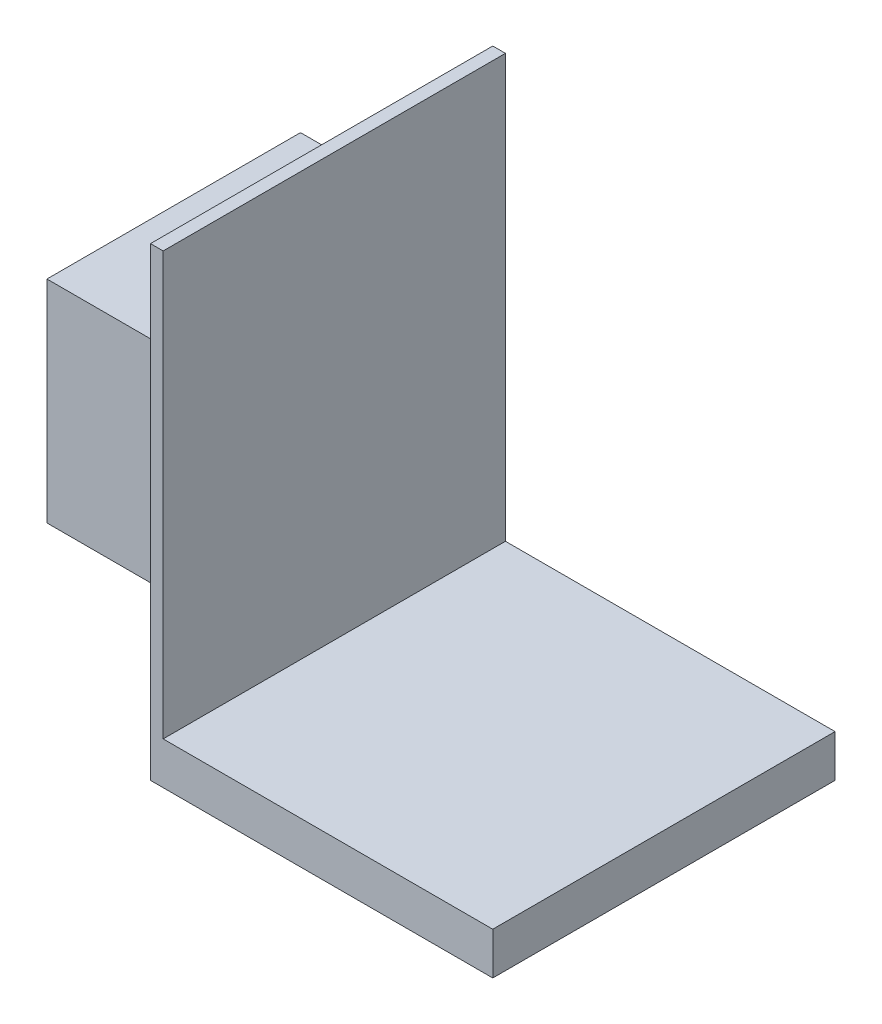
ISO-10303-21;
HEADER;
FILE_DESCRIPTION(('STEP AP214'),'2;1');
FILE_NAME('part.step','',(''),(''),'','','');
FILE_SCHEMA(('AUTOMOTIVE_DESIGN { 1 0 10303 214 1 1 1 1 }'));
ENDSEC;
DATA;
#1=APPLICATION_CONTEXT('core data for automotive mechanical design processes');
#2=APPLICATION_PROTOCOL_DEFINITION('international standard','automotive_design',2000,#1);
#3=PRODUCT_CONTEXT('',#1,'mechanical');
#4=PRODUCT('Part','Part','',(#3));
#5=PRODUCT_RELATED_PRODUCT_CATEGORY('part','',(#4));
#6=PRODUCT_DEFINITION_FORMATION('','',#4);
#7=PRODUCT_DEFINITION_CONTEXT('part definition',#1,'design');
#8=PRODUCT_DEFINITION('design','',#6,#7);
#9=PRODUCT_DEFINITION_SHAPE('','',#8);
#10=(LENGTH_UNIT() NAMED_UNIT(*) SI_UNIT(.MILLI.,.METRE.));
#11=(NAMED_UNIT(*) PLANE_ANGLE_UNIT() SI_UNIT($,.RADIAN.));
#12=(NAMED_UNIT(*) SI_UNIT($,.STERADIAN.) SOLID_ANGLE_UNIT());
#13=UNCERTAINTY_MEASURE_WITH_UNIT(LENGTH_MEASURE(1.E-05),#10,'distance_accuracy_value','');
#14=(GEOMETRIC_REPRESENTATION_CONTEXT(3) GLOBAL_UNCERTAINTY_ASSIGNED_CONTEXT((#13)) GLOBAL_UNIT_ASSIGNED_CONTEXT((#10,
#11,#12)) REPRESENTATION_CONTEXT('',''));
#15=CARTESIAN_POINT('',(0.,0.,0.));
#16=DIRECTION('',(0.,0.,1.));
#17=DIRECTION('',(1.,0.,0.));
#18=AXIS2_PLACEMENT_3D('',#15,#16,#17);
#19=CARTESIAN_POINT('',(-75.5,80.,-30.));
#20=DIRECTION('',(0.,-1.,0.));
#21=DIRECTION('',(0.,0.,-1.));
#22=AXIS2_PLACEMENT_3D('',#19,#20,#21);
#23=PLANE('',#22);
#24=DIRECTION('',(0.,0.,-1.));
#25=VECTOR('',#24,1.);
#26=CARTESIAN_POINT('',(-40.5,80.,-30.));
#27=LINE('',#26,#25);
#28=CARTESIAN_POINT('',(-40.5,80.,30.));
#29=VERTEX_POINT('',#28);
#30=CARTESIAN_POINT('',(-40.5,80.,-30.));
#31=VERTEX_POINT('',#30);
#32=EDGE_CURVE('E318',#29,#31,#27,.T.);
#33=ORIENTED_EDGE('',*,*,#32,.T.);
#34=DIRECTION('',(1.,0.,0.));
#35=VECTOR('',#34,1.);
#36=CARTESIAN_POINT('',(-75.5,80.,-30.));
#37=LINE('',#36,#35);
#38=CARTESIAN_POINT('',(-75.5,80.,-30.));
#39=VERTEX_POINT('',#38);
#40=EDGE_CURVE('E331',#39,#31,#37,.T.);
#41=ORIENTED_EDGE('',*,*,#40,.F.);
#42=DIRECTION('',(0.,0.,-1.));
#43=VECTOR('',#42,1.);
#44=CARTESIAN_POINT('',(-75.5,80.,-30.));
#45=LINE('',#44,#43);
#46=CARTESIAN_POINT('',(-75.5,80.,30.));
#47=VERTEX_POINT('',#46);
#48=EDGE_CURVE('E308',#47,#39,#45,.T.);
#49=ORIENTED_EDGE('',*,*,#48,.F.);
#50=DIRECTION('',(1.,0.,0.));
#51=VECTOR('',#50,1.);
#52=CARTESIAN_POINT('',(-75.5,80.,30.));
#53=LINE('',#52,#51);
#54=EDGE_CURVE('E334',#47,#29,#53,.T.);
#55=ORIENTED_EDGE('',*,*,#54,.T.);
#56=EDGE_LOOP('',(#33,#41,#49,#55));
#57=FACE_BOUND('',#56,.T.);
#58=CARTESIAN_POINT('',(-55.5,80.,15.));
#59=DIRECTION('',(0.,1.,0.));
#60=DIRECTION('',(0.,0.,1.));
#61=AXIS2_PLACEMENT_3D('',#58,#59,#60);
#62=CIRCLE('',#61,5.);
#63=CARTESIAN_POINT('',(-55.5,80.,20.));
#64=VERTEX_POINT('',#63);
#65=EDGE_CURVE('E235',#64,#64,#62,.T.);
#66=ORIENTED_EDGE('',*,*,#65,.F.);
#67=EDGE_LOOP('',(#66));
#68=FACE_BOUND('',#67,.T.);
#69=CARTESIAN_POINT('',(-55.5,80.,-15.));
#70=DIRECTION('',(0.,1.,0.));
#71=DIRECTION('',(0.,0.,1.));
#72=AXIS2_PLACEMENT_3D('',#69,#70,#71);
#73=CIRCLE('',#72,5.);
#74=CARTESIAN_POINT('',(-55.5,80.,-9.99999999999998));
#75=VERTEX_POINT('',#74);
#76=EDGE_CURVE('E293',#75,#75,#73,.T.);
#77=ORIENTED_EDGE('',*,*,#76,.F.);
#78=EDGE_LOOP('',(#77));
#79=FACE_BOUND('',#78,.T.);
#80=DIRECTION('',(-1.,0.,0.));
#81=VECTOR('',#80,1.);
#82=CARTESIAN_POINT('',(-70.5,80.,-9.99999999999999));
#83=LINE('',#82,#81);
#84=CARTESIAN_POINT('',(-65.5,80.,-9.99999999999999));
#85=VERTEX_POINT('',#84);
#86=CARTESIAN_POINT('',(-70.5,80.,-9.99999999999999));
#87=VERTEX_POINT('',#86);
#88=EDGE_CURVE('E194',#85,#87,#83,.T.);
#89=ORIENTED_EDGE('',*,*,#88,.F.);
#90=DIRECTION('',(0.,0.,1.));
#91=VECTOR('',#90,1.);
#92=CARTESIAN_POINT('',(-65.5,80.,-9.99999999999999));
#93=LINE('',#92,#91);
#94=CARTESIAN_POINT('',(-65.5,80.,10.));
#95=VERTEX_POINT('',#94);
#96=EDGE_CURVE('E236',#85,#95,#93,.T.);
#97=ORIENTED_EDGE('',*,*,#96,.T.);
#98=DIRECTION('',(-1.,0.,0.));
#99=VECTOR('',#98,1.);
#100=CARTESIAN_POINT('',(-70.5,80.,10.));
#101=LINE('',#100,#99);
#102=CARTESIAN_POINT('',(-70.5,80.,10.));
#103=VERTEX_POINT('',#102);
#104=EDGE_CURVE('E209',#95,#103,#101,.T.);
#105=ORIENTED_EDGE('',*,*,#104,.T.);
#106=DIRECTION('',(0.,0.,1.));
#107=VECTOR('',#106,1.);
#108=CARTESIAN_POINT('',(-70.5,80.,-9.99999999999999));
#109=LINE('',#108,#107);
#110=EDGE_CURVE('E233',#87,#103,#109,.T.);
#111=ORIENTED_EDGE('',*,*,#110,.F.);
#112=EDGE_LOOP('',(#89,#97,#105,#111));
#113=FACE_BOUND('',#112,.T.);
#114=ADVANCED_FACE('F35',(#57,#68,#79,#113),#23,.F.);
#115=CARTESIAN_POINT('',(-75.5,30.,-30.));
#116=DIRECTION('',(0.,1.,0.));
#117=DIRECTION('',(0.,0.,1.));
#118=AXIS2_PLACEMENT_3D('',#115,#116,#117);
#119=PLANE('',#118);
#120=DIRECTION('',(0.,0.,1.));
#121=VECTOR('',#120,1.);
#122=CARTESIAN_POINT('',(-40.5,30.,-30.));
#123=LINE('',#122,#121);
#124=CARTESIAN_POINT('',(-40.5,30.,-30.));
#125=VERTEX_POINT('',#124);
#126=CARTESIAN_POINT('',(-40.5,30.,30.));
#127=VERTEX_POINT('',#126);
#128=EDGE_CURVE('E309',#125,#127,#123,.T.);
#129=ORIENTED_EDGE('',*,*,#128,.T.);
#130=DIRECTION('',(1.,0.,0.));
#131=VECTOR('',#130,1.);
#132=CARTESIAN_POINT('',(-75.5,30.,30.));
#133=LINE('',#132,#131);
#134=CARTESIAN_POINT('',(-75.5,30.,30.));
#135=VERTEX_POINT('',#134);
#136=EDGE_CURVE('E315',#135,#127,#133,.T.);
#137=ORIENTED_EDGE('',*,*,#136,.F.);
#138=DIRECTION('',(0.,0.,1.));
#139=VECTOR('',#138,1.);
#140=CARTESIAN_POINT('',(-75.5,30.,-30.));
#141=LINE('',#140,#139);
#142=CARTESIAN_POINT('',(-75.5,30.,-30.));
#143=VERTEX_POINT('',#142);
#144=EDGE_CURVE('E313',#143,#135,#141,.T.);
#145=ORIENTED_EDGE('',*,*,#144,.F.);
#146=DIRECTION('',(1.,0.,0.));
#147=VECTOR('',#146,1.);
#148=CARTESIAN_POINT('',(-75.5,30.,-30.));
#149=LINE('',#148,#147);
#150=EDGE_CURVE('E328',#143,#125,#149,.T.);
#151=ORIENTED_EDGE('',*,*,#150,.T.);
#152=EDGE_LOOP('',(#129,#137,#145,#151));
#153=FACE_BOUND('',#152,.T.);
#154=CARTESIAN_POINT('',(-55.5,30.,15.));
#155=DIRECTION('',(0.,1.,0.));
#156=DIRECTION('',(0.,0.,1.));
#157=AXIS2_PLACEMENT_3D('',#154,#155,#156);
#158=CIRCLE('',#157,5.);
#159=CARTESIAN_POINT('',(-55.5,30.,20.));
#160=VERTEX_POINT('',#159);
#161=EDGE_CURVE('E297',#160,#160,#158,.F.);
#162=ORIENTED_EDGE('',*,*,#161,.F.);
#163=EDGE_LOOP('',(#162));
#164=FACE_BOUND('',#163,.T.);
#165=CARTESIAN_POINT('',(-55.5,30.,-15.));
#166=DIRECTION('',(0.,1.,0.));
#167=DIRECTION('',(0.,0.,1.));
#168=AXIS2_PLACEMENT_3D('',#165,#166,#167);
#169=CIRCLE('',#168,5.);
#170=CARTESIAN_POINT('',(-55.5,30.,-9.99999999999998));
#171=VERTEX_POINT('',#170);
#172=EDGE_CURVE('E296',#171,#171,#169,.F.);
#173=ORIENTED_EDGE('',*,*,#172,.F.);
#174=EDGE_LOOP('',(#173));
#175=FACE_BOUND('',#174,.T.);
#176=DIRECTION('',(1.,0.,0.));
#177=VECTOR('',#176,1.);
#178=CARTESIAN_POINT('',(-70.5,30.,-9.99999999999999));
#179=LINE('',#178,#177);
#180=CARTESIAN_POINT('',(-70.5,30.,-9.99999999999999));
#181=VERTEX_POINT('',#180);
#182=CARTESIAN_POINT('',(-65.5,30.,-9.99999999999999));
#183=VERTEX_POINT('',#182);
#184=EDGE_CURVE('E245',#181,#183,#179,.T.);
#185=ORIENTED_EDGE('',*,*,#184,.F.);
#186=DIRECTION('',(0.,0.,1.));
#187=VECTOR('',#186,1.);
#188=CARTESIAN_POINT('',(-70.5,30.,-9.99999999999999));
#189=LINE('',#188,#187);
#190=CARTESIAN_POINT('',(-70.5,30.,10.));
#191=VERTEX_POINT('',#190);
#192=EDGE_CURVE('E224',#181,#191,#189,.T.);
#193=ORIENTED_EDGE('',*,*,#192,.T.);
#194=DIRECTION('',(1.,0.,0.));
#195=VECTOR('',#194,1.);
#196=CARTESIAN_POINT('',(-70.5,30.,10.));
#197=LINE('',#196,#195);
#198=CARTESIAN_POINT('',(-65.5,30.,10.));
#199=VERTEX_POINT('',#198);
#200=EDGE_CURVE('E265',#191,#199,#197,.T.);
#201=ORIENTED_EDGE('',*,*,#200,.T.);
#202=DIRECTION('',(0.,0.,1.));
#203=VECTOR('',#202,1.);
#204=CARTESIAN_POINT('',(-65.5,30.,-9.99999999999999));
#205=LINE('',#204,#203);
#206=EDGE_CURVE('E264',#183,#199,#205,.T.);
#207=ORIENTED_EDGE('',*,*,#206,.F.);
#208=EDGE_LOOP('',(#185,#193,#201,#207));
#209=FACE_BOUND('',#208,.T.);
#210=ADVANCED_FACE('F415',(#153,#164,#175,#209),#119,.F.);
#211=CARTESIAN_POINT('',(-75.5,0.,0.));
#212=DIRECTION('',(1.,0.,0.));
#213=DIRECTION('',(0.,0.,-1.));
#214=AXIS2_PLACEMENT_3D('',#211,#212,#213);
#215=PLANE('',#214);
#216=DIRECTION('',(0.,-1.,0.));
#217=VECTOR('',#216,1.);
#218=CARTESIAN_POINT('',(-75.5,35.,-9.99999999999999));
#219=LINE('',#218,#217);
#220=CARTESIAN_POINT('',(-75.5,40.,-9.99999999999999));
#221=VERTEX_POINT('',#220);
#222=CARTESIAN_POINT('',(-75.5,35.,-9.99999999999999));
#223=VERTEX_POINT('',#222);
#224=EDGE_CURVE('E255',#221,#223,#219,.T.);
#225=ORIENTED_EDGE('',*,*,#224,.F.);
#226=DIRECTION('',(0.,0.,1.));
#227=VECTOR('',#226,1.);
#228=CARTESIAN_POINT('',(-75.5,40.,-9.99999999999999));
#229=LINE('',#228,#227);
#230=CARTESIAN_POINT('',(-75.5,40.,10.));
#231=VERTEX_POINT('',#230);
#232=EDGE_CURVE('E287',#221,#231,#229,.T.);
#233=ORIENTED_EDGE('',*,*,#232,.T.);
#234=DIRECTION('',(0.,-1.,0.));
#235=VECTOR('',#234,1.);
#236=CARTESIAN_POINT('',(-75.5,35.,10.));
#237=LINE('',#236,#235);
#238=CARTESIAN_POINT('',(-75.5,35.,10.));
#239=VERTEX_POINT('',#238);
#240=EDGE_CURVE('E272',#231,#239,#237,.T.);
#241=ORIENTED_EDGE('',*,*,#240,.T.);
#242=DIRECTION('',(0.,0.,1.));
#243=VECTOR('',#242,1.);
#244=CARTESIAN_POINT('',(-75.5,35.,-9.99999999999999));
#245=LINE('',#244,#243);
#246=EDGE_CURVE('E284',#223,#239,#245,.T.);
#247=ORIENTED_EDGE('',*,*,#246,.F.);
#248=EDGE_LOOP('',(#225,#233,#241,#247));
#249=FACE_BOUND('',#248,.T.);
#250=DIRECTION('',(0.,1.,0.));
#251=VECTOR('',#250,1.);
#252=CARTESIAN_POINT('',(-75.5,30.,30.));
#253=LINE('',#252,#251);
#254=EDGE_CURVE('E305',#135,#47,#253,.T.);
#255=ORIENTED_EDGE('',*,*,#254,.T.);
#256=ORIENTED_EDGE('',*,*,#48,.T.);
#257=DIRECTION('',(0.,-1.,0.));
#258=VECTOR('',#257,1.);
#259=CARTESIAN_POINT('',(-75.5,30.,-30.));
#260=LINE('',#259,#258);
#261=EDGE_CURVE('E311',#39,#143,#260,.T.);
#262=ORIENTED_EDGE('',*,*,#261,.T.);
#263=ORIENTED_EDGE('',*,*,#144,.T.);
#264=EDGE_LOOP('',(#255,#256,#262,#263));
#265=FACE_BOUND('',#264,.T.);
#266=DIRECTION('',(0.,-1.,0.));
#267=VECTOR('',#266,1.);
#268=CARTESIAN_POINT('',(-75.5,75.,-9.99999999999999));
#269=LINE('',#268,#267);
#270=CARTESIAN_POINT('',(-75.5,75.,-9.99999999999999));
#271=VERTEX_POINT('',#270);
#272=CARTESIAN_POINT('',(-75.5,70.,-9.99999999999999));
#273=VERTEX_POINT('',#272);
#274=EDGE_CURVE('E203',#271,#273,#269,.T.);
#275=ORIENTED_EDGE('',*,*,#274,.F.);
#276=DIRECTION('',(0.,0.,1.));
#277=VECTOR('',#276,1.);
#278=CARTESIAN_POINT('',(-75.5,75.,-9.99999999999999));
#279=LINE('',#278,#277);
#280=CARTESIAN_POINT('',(-75.5,75.,10.));
#281=VERTEX_POINT('',#280);
#282=EDGE_CURVE('E193',#271,#281,#279,.T.);
#283=ORIENTED_EDGE('',*,*,#282,.T.);
#284=DIRECTION('',(0.,-1.,0.));
#285=VECTOR('',#284,1.);
#286=CARTESIAN_POINT('',(-75.5,75.,10.));
#287=LINE('',#286,#285);
#288=CARTESIAN_POINT('',(-75.5,70.,10.));
#289=VERTEX_POINT('',#288);
#290=EDGE_CURVE('E226',#281,#289,#287,.T.);
#291=ORIENTED_EDGE('',*,*,#290,.T.);
#292=DIRECTION('',(0.,0.,1.));
#293=VECTOR('',#292,1.);
#294=CARTESIAN_POINT('',(-75.5,70.,-9.99999999999999));
#295=LINE('',#294,#293);
#296=EDGE_CURVE('E241',#273,#289,#295,.T.);
#297=ORIENTED_EDGE('',*,*,#296,.F.);
#298=EDGE_LOOP('',(#275,#283,#291,#297));
#299=FACE_BOUND('',#298,.T.);
#300=ADVANCED_FACE('F422',(#249,#265,#299),#215,.F.);
#301=CARTESIAN_POINT('',(-40.5,10.,40.5));
#302=DIRECTION('',(1.,0.,0.));
#303=DIRECTION('',(0.,0.,-1.));
#304=AXIS2_PLACEMENT_3D('',#301,#302,#303);
#305=PLANE('',#304);
#306=DIRECTION('',(0.,0.,1.));
#307=VECTOR('',#306,1.);
#308=CARTESIAN_POINT('',(-40.5,0.,40.5));
#309=LINE('',#308,#307);
#310=CARTESIAN_POINT('',(-40.5,0.,-40.5));
#311=VERTEX_POINT('',#310);
#312=CARTESIAN_POINT('',(-40.5,0.,40.5));
#313=VERTEX_POINT('',#312);
#314=EDGE_CURVE('E370',#311,#313,#309,.T.);
#315=ORIENTED_EDGE('',*,*,#314,.T.);
#316=DIRECTION('',(0.,-1.,0.));
#317=VECTOR('',#316,1.);
#318=CARTESIAN_POINT('',(-40.5,10.,40.5));
#319=LINE('',#318,#317);
#320=CARTESIAN_POINT('',(-40.5,110.,40.5));
#321=VERTEX_POINT('',#320);
#322=EDGE_CURVE('E375',#321,#313,#319,.T.);
#323=ORIENTED_EDGE('',*,*,#322,.F.);
#324=DIRECTION('',(0.,0.,1.));
#325=VECTOR('',#324,1.);
#326=CARTESIAN_POINT('',(-40.5,110.,0.));
#327=LINE('',#326,#325);
#328=CARTESIAN_POINT('',(-40.5,110.,-40.5));
#329=VERTEX_POINT('',#328);
#330=EDGE_CURVE('E338',#329,#321,#327,.T.);
#331=ORIENTED_EDGE('',*,*,#330,.F.);
#332=DIRECTION('',(0.,-1.,0.));
#333=VECTOR('',#332,1.);
#334=CARTESIAN_POINT('',(-40.5,10.,-40.5));
#335=LINE('',#334,#333);
#336=EDGE_CURVE('E43',#329,#311,#335,.T.);
#337=ORIENTED_EDGE('',*,*,#336,.T.);
#338=EDGE_LOOP('',(#315,#323,#331,#337));
#339=FACE_BOUND('',#338,.T.);
#340=DIRECTION('',(0.,1.,0.));
#341=VECTOR('',#340,1.);
#342=CARTESIAN_POINT('',(-40.5,30.,30.));
#343=LINE('',#342,#341);
#344=EDGE_CURVE('E300',#127,#29,#343,.T.);
#345=ORIENTED_EDGE('',*,*,#344,.F.);
#346=ORIENTED_EDGE('',*,*,#128,.F.);
#347=DIRECTION('',(0.,-1.,0.));
#348=VECTOR('',#347,1.);
#349=CARTESIAN_POINT('',(-40.5,30.,-30.));
#350=LINE('',#349,#348);
#351=EDGE_CURVE('E321',#31,#125,#350,.T.);
#352=ORIENTED_EDGE('',*,*,#351,.F.);
#353=ORIENTED_EDGE('',*,*,#32,.F.);
#354=EDGE_LOOP('',(#345,#346,#352,#353));
#355=FACE_BOUND('',#354,.T.);
#356=ADVANCED_FACE('F381',(#339,#355),#305,.F.);
#357=CARTESIAN_POINT('',(0.,10.,0.));
#358=DIRECTION('',(0.,-1.,0.));
#359=DIRECTION('',(0.,0.,-1.));
#360=AXIS2_PLACEMENT_3D('',#357,#358,#359);
#361=PLANE('',#360);
#362=DIRECTION('',(0.,0.,-1.));
#363=VECTOR('',#362,1.);
#364=CARTESIAN_POINT('',(-37.5,10.,0.));
#365=LINE('',#364,#363);
#366=CARTESIAN_POINT('',(-37.5,10.,40.5));
#367=VERTEX_POINT('',#366);
#368=CARTESIAN_POINT('',(-37.5,10.,-40.5));
#369=VERTEX_POINT('',#368);
#370=EDGE_CURVE('E337',#367,#369,#365,.T.);
#371=ORIENTED_EDGE('',*,*,#370,.F.);
#372=DIRECTION('',(1.,0.,0.));
#373=VECTOR('',#372,1.);
#374=CARTESIAN_POINT('',(-40.5,10.,40.5));
#375=LINE('',#374,#373);
#376=CARTESIAN_POINT('',(40.5,10.,40.5));
#377=VERTEX_POINT('',#376);
#378=EDGE_CURVE('E363',#367,#377,#375,.T.);
#379=ORIENTED_EDGE('',*,*,#378,.T.);
#380=DIRECTION('',(0.,0.,-1.));
#381=VECTOR('',#380,1.);
#382=CARTESIAN_POINT('',(40.5,10.,40.5));
#383=LINE('',#382,#381);
#384=CARTESIAN_POINT('',(40.5,10.,-40.5));
#385=VERTEX_POINT('',#384);
#386=EDGE_CURVE('E357',#377,#385,#383,.T.);
#387=ORIENTED_EDGE('',*,*,#386,.T.);
#388=DIRECTION('',(-1.,0.,0.));
#389=VECTOR('',#388,1.);
#390=CARTESIAN_POINT('',(-40.5,10.,-40.5));
#391=LINE('',#390,#389);
#392=EDGE_CURVE('E360',#385,#369,#391,.T.);
#393=ORIENTED_EDGE('',*,*,#392,.T.);
#394=EDGE_LOOP('',(#371,#379,#387,#393));
#395=FACE_BOUND('',#394,.T.);
#396=ADVANCED_FACE('F398',(#395),#361,.F.);
#397=CARTESIAN_POINT('',(40.5,10.,40.5));
#398=DIRECTION('',(-1.,0.,0.));
#399=DIRECTION('',(0.,0.,1.));
#400=AXIS2_PLACEMENT_3D('',#397,#398,#399);
#401=PLANE('',#400);
#402=DIRECTION('',(0.,0.,-1.));
#403=VECTOR('',#402,1.);
#404=CARTESIAN_POINT('',(40.5,0.,40.5));
#405=LINE('',#404,#403);
#406=CARTESIAN_POINT('',(40.5,0.,40.5));
#407=VERTEX_POINT('',#406);
#408=CARTESIAN_POINT('',(40.5,0.,-40.5));
#409=VERTEX_POINT('',#408);
#410=EDGE_CURVE('E356',#407,#409,#405,.T.);
#411=ORIENTED_EDGE('',*,*,#410,.T.);
#412=DIRECTION('',(0.,-1.,0.));
#413=VECTOR('',#412,1.);
#414=CARTESIAN_POINT('',(40.5,10.,-40.5));
#415=LINE('',#414,#413);
#416=EDGE_CURVE('E11',#385,#409,#415,.T.);
#417=ORIENTED_EDGE('',*,*,#416,.F.);
#418=ORIENTED_EDGE('',*,*,#386,.F.);
#419=DIRECTION('',(0.,-1.,0.));
#420=VECTOR('',#419,1.);
#421=CARTESIAN_POINT('',(40.5,10.,40.5));
#422=LINE('',#421,#420);
#423=EDGE_CURVE('E365',#377,#407,#422,.T.);
#424=ORIENTED_EDGE('',*,*,#423,.T.);
#425=EDGE_LOOP('',(#411,#417,#418,#424));
#426=FACE_BOUND('',#425,.T.);
#427=ADVANCED_FACE('F37',(#426),#401,.F.);
#428=CARTESIAN_POINT('',(-40.5,10.,-40.5));
#429=DIRECTION('',(0.,0.,1.));
#430=DIRECTION('',(1.,0.,0.));
#431=AXIS2_PLACEMENT_3D('',#428,#429,#430);
#432=PLANE('',#431);
#433=DIRECTION('',(-1.,0.,0.));
#434=VECTOR('',#433,1.);
#435=CARTESIAN_POINT('',(-40.5,0.,-40.5));
#436=LINE('',#435,#434);
#437=EDGE_CURVE('E368',#409,#311,#436,.T.);
#438=ORIENTED_EDGE('',*,*,#437,.T.);
#439=ORIENTED_EDGE('',*,*,#336,.F.);
#440=DIRECTION('',(-1.,0.,0.));
#441=VECTOR('',#440,1.);
#442=CARTESIAN_POINT('',(0.,110.,-40.5));
#443=LINE('',#442,#441);
#444=CARTESIAN_POINT('',(-37.5,110.,-40.5));
#445=VERTEX_POINT('',#444);
#446=EDGE_CURVE('E345',#445,#329,#443,.T.);
#447=ORIENTED_EDGE('',*,*,#446,.F.);
#448=DIRECTION('',(0.,-1.,0.));
#449=VECTOR('',#448,1.);
#450=CARTESIAN_POINT('',(-37.5,110.,-40.5));
#451=LINE('',#450,#449);
#452=EDGE_CURVE('E348',#445,#369,#451,.T.);
#453=ORIENTED_EDGE('',*,*,#452,.T.);
#454=ORIENTED_EDGE('',*,*,#392,.F.);
#455=ORIENTED_EDGE('',*,*,#416,.T.);
#456=EDGE_LOOP('',(#438,#439,#447,#453,#454,#455));
#457=FACE_BOUND('',#456,.T.);
#458=ADVANCED_FACE('F406',(#457),#432,.F.);
#459=CARTESIAN_POINT('',(-40.5,10.,40.5));
#460=DIRECTION('',(0.,0.,-1.));
#461=DIRECTION('',(-1.,0.,0.));
#462=AXIS2_PLACEMENT_3D('',#459,#460,#461);
#463=PLANE('',#462);
#464=DIRECTION('',(1.,0.,0.));
#465=VECTOR('',#464,1.);
#466=CARTESIAN_POINT('',(-40.5,0.,40.5));
#467=LINE('',#466,#465);
#468=EDGE_CURVE('E361',#313,#407,#467,.T.);
#469=ORIENTED_EDGE('',*,*,#468,.T.);
#470=ORIENTED_EDGE('',*,*,#423,.F.);
#471=ORIENTED_EDGE('',*,*,#378,.F.);
#472=DIRECTION('',(0.,-1.,0.));
#473=VECTOR('',#472,1.);
#474=CARTESIAN_POINT('',(-37.5,110.,40.5));
#475=LINE('',#474,#473);
#476=CARTESIAN_POINT('',(-37.5,110.,40.5));
#477=VERTEX_POINT('',#476);
#478=EDGE_CURVE('E353',#477,#367,#475,.T.);
#479=ORIENTED_EDGE('',*,*,#478,.F.);
#480=DIRECTION('',(1.,0.,0.));
#481=VECTOR('',#480,1.);
#482=CARTESIAN_POINT('',(0.,110.,40.5));
#483=LINE('',#482,#481);
#484=EDGE_CURVE('E341',#321,#477,#483,.T.);
#485=ORIENTED_EDGE('',*,*,#484,.F.);
#486=ORIENTED_EDGE('',*,*,#322,.T.);
#487=EDGE_LOOP('',(#469,#470,#471,#479,#485,#486));
#488=FACE_BOUND('',#487,.T.);
#489=ADVANCED_FACE('F391',(#488),#463,.F.);
#490=CARTESIAN_POINT('',(0.,0.,0.));
#491=DIRECTION('',(0.,-1.,0.));
#492=DIRECTION('',(0.,0.,-1.));
#493=AXIS2_PLACEMENT_3D('',#490,#491,#492);
#494=PLANE('',#493);
#495=ORIENTED_EDGE('',*,*,#410,.F.);
#496=ORIENTED_EDGE('',*,*,#468,.F.);
#497=ORIENTED_EDGE('',*,*,#314,.F.);
#498=ORIENTED_EDGE('',*,*,#437,.F.);
#499=EDGE_LOOP('',(#495,#496,#497,#498));
#500=FACE_BOUND('',#499,.T.);
#501=ADVANCED_FACE('F388',(#500),#494,.T.);
#502=CARTESIAN_POINT('',(-37.5,110.,0.));
#503=DIRECTION('',(-1.,0.,0.));
#504=DIRECTION('',(0.,0.,1.));
#505=AXIS2_PLACEMENT_3D('',#502,#503,#504);
#506=PLANE('',#505);
#507=ORIENTED_EDGE('',*,*,#370,.T.);
#508=ORIENTED_EDGE('',*,*,#452,.F.);
#509=DIRECTION('',(0.,0.,-1.));
#510=VECTOR('',#509,1.);
#511=CARTESIAN_POINT('',(-37.5,110.,0.));
#512=LINE('',#511,#510);
#513=EDGE_CURVE('E343',#477,#445,#512,.T.);
#514=ORIENTED_EDGE('',*,*,#513,.F.);
#515=ORIENTED_EDGE('',*,*,#478,.T.);
#516=EDGE_LOOP('',(#507,#508,#514,#515));
#517=FACE_BOUND('',#516,.T.);
#518=ADVANCED_FACE('F402',(#517),#506,.F.);
#519=CARTESIAN_POINT('',(0.,110.,0.));
#520=DIRECTION('',(0.,1.,0.));
#521=DIRECTION('',(0.,0.,1.));
#522=AXIS2_PLACEMENT_3D('',#519,#520,#521);
#523=PLANE('',#522);
#524=ORIENTED_EDGE('',*,*,#330,.T.);
#525=ORIENTED_EDGE('',*,*,#484,.T.);
#526=ORIENTED_EDGE('',*,*,#513,.T.);
#527=ORIENTED_EDGE('',*,*,#446,.T.);
#528=EDGE_LOOP('',(#524,#525,#526,#527));
#529=FACE_BOUND('',#528,.T.);
#530=ADVANCED_FACE('F405',(#529),#523,.T.);
#531=CARTESIAN_POINT('',(-75.5,30.,30.));
#532=DIRECTION('',(0.,0.,-1.));
#533=DIRECTION('',(-1.,0.,0.));
#534=AXIS2_PLACEMENT_3D('',#531,#532,#533);
#535=PLANE('',#534);
#536=ORIENTED_EDGE('',*,*,#344,.T.);
#537=ORIENTED_EDGE('',*,*,#54,.F.);
#538=ORIENTED_EDGE('',*,*,#254,.F.);
#539=ORIENTED_EDGE('',*,*,#136,.T.);
#540=EDGE_LOOP('',(#536,#537,#538,#539));
#541=FACE_BOUND('',#540,.T.);
#542=ADVANCED_FACE('F429',(#541),#535,.F.);
#543=CARTESIAN_POINT('',(-75.5,30.,-30.));
#544=DIRECTION('',(0.,0.,1.));
#545=DIRECTION('',(1.,0.,0.));
#546=AXIS2_PLACEMENT_3D('',#543,#544,#545);
#547=PLANE('',#546);
#548=ORIENTED_EDGE('',*,*,#351,.T.);
#549=ORIENTED_EDGE('',*,*,#150,.F.);
#550=ORIENTED_EDGE('',*,*,#261,.F.);
#551=ORIENTED_EDGE('',*,*,#40,.T.);
#552=EDGE_LOOP('',(#548,#549,#550,#551));
#553=FACE_BOUND('',#552,.T.);
#554=ADVANCED_FACE('F428',(#553),#547,.F.);
#555=CARTESIAN_POINT('',(-55.5,-0.001000000000001,15.));
#556=DIRECTION('',(0.,1.,0.));
#557=DIRECTION('',(0.,0.,1.));
#558=AXIS2_PLACEMENT_3D('',#555,#556,#557);
#559=CYLINDRICAL_SURFACE('',#558,5.);
#560=ORIENTED_EDGE('',*,*,#65,.T.);
#561=EDGE_LOOP('',(#560));
#562=FACE_BOUND('',#561,.T.);
#563=ORIENTED_EDGE('',*,*,#161,.T.);
#564=EDGE_LOOP('',(#563));
#565=FACE_BOUND('',#564,.T.);
#566=ADVANCED_FACE('F453',(#562,#565),#559,.F.);
#567=CARTESIAN_POINT('',(-55.5,-0.001000000000001,-15.));
#568=DIRECTION('',(0.,1.,0.));
#569=DIRECTION('',(0.,0.,1.));
#570=AXIS2_PLACEMENT_3D('',#567,#568,#569);
#571=CYLINDRICAL_SURFACE('',#570,5.);
#572=ORIENTED_EDGE('',*,*,#76,.T.);
#573=EDGE_LOOP('',(#572));
#574=FACE_BOUND('',#573,.T.);
#575=ORIENTED_EDGE('',*,*,#172,.T.);
#576=EDGE_LOOP('',(#575));
#577=FACE_BOUND('',#576,.T.);
#578=ADVANCED_FACE('F456',(#574,#577),#571,.F.);
#579=CARTESIAN_POINT('',(-70.5,30.,-9.99999999999999));
#580=DIRECTION('',(-1.,0.,0.));
#581=DIRECTION('',(0.,0.,1.));
#582=AXIS2_PLACEMENT_3D('',#579,#580,#581);
#583=PLANE('',#582);
#584=DIRECTION('',(0.,-1.,0.));
#585=VECTOR('',#584,1.);
#586=CARTESIAN_POINT('',(-70.5,30.,10.));
#587=LINE('',#586,#585);
#588=CARTESIAN_POINT('',(-70.5,35.,10.));
#589=VERTEX_POINT('',#588);
#590=EDGE_CURVE('E249',#589,#191,#587,.T.);
#591=ORIENTED_EDGE('',*,*,#590,.T.);
#592=ORIENTED_EDGE('',*,*,#192,.F.);
#593=DIRECTION('',(0.,-1.,0.));
#594=VECTOR('',#593,1.);
#595=CARTESIAN_POINT('',(-70.5,30.,-9.99999999999999));
#596=LINE('',#595,#594);
#597=CARTESIAN_POINT('',(-70.5,35.,-9.99999999999999));
#598=VERTEX_POINT('',#597);
#599=EDGE_CURVE('E261',#598,#181,#596,.T.);
#600=ORIENTED_EDGE('',*,*,#599,.F.);
#601=DIRECTION('',(0.,0.,1.));
#602=VECTOR('',#601,1.);
#603=CARTESIAN_POINT('',(-70.5,35.,-9.99999999999999));
#604=LINE('',#603,#602);
#605=EDGE_CURVE('E282',#598,#589,#604,.T.);
#606=ORIENTED_EDGE('',*,*,#605,.T.);
#607=EDGE_LOOP('',(#591,#592,#600,#606));
#608=FACE_BOUND('',#607,.T.);
#609=ADVANCED_FACE('F460',(#608),#583,.F.);
#610=CARTESIAN_POINT('',(-75.5,35.,-9.99999999999999));
#611=DIRECTION('',(0.,-1.,0.));
#612=DIRECTION('',(0.,0.,-1.));
#613=AXIS2_PLACEMENT_3D('',#610,#611,#612);
#614=PLANE('',#613);
#615=DIRECTION('',(1.,0.,0.));
#616=VECTOR('',#615,1.);
#617=CARTESIAN_POINT('',(-75.5,35.,10.));
#618=LINE('',#617,#616);
#619=EDGE_CURVE('E275',#239,#589,#618,.T.);
#620=ORIENTED_EDGE('',*,*,#619,.T.);
#621=ORIENTED_EDGE('',*,*,#605,.F.);
#622=DIRECTION('',(1.,0.,0.));
#623=VECTOR('',#622,1.);
#624=CARTESIAN_POINT('',(-75.5,35.,-9.99999999999999));
#625=LINE('',#624,#623);
#626=EDGE_CURVE('E258',#223,#598,#625,.T.);
#627=ORIENTED_EDGE('',*,*,#626,.F.);
#628=ORIENTED_EDGE('',*,*,#246,.T.);
#629=EDGE_LOOP('',(#620,#621,#627,#628));
#630=FACE_BOUND('',#629,.T.);
#631=ADVANCED_FACE('F470',(#630),#614,.F.);
#632=CARTESIAN_POINT('',(-65.5,40.,-9.99999999999999));
#633=DIRECTION('',(0.,1.,0.));
#634=DIRECTION('',(0.,0.,1.));
#635=AXIS2_PLACEMENT_3D('',#632,#633,#634);
#636=PLANE('',#635);
#637=DIRECTION('',(-1.,0.,0.));
#638=VECTOR('',#637,1.);
#639=CARTESIAN_POINT('',(-65.5,40.,10.));
#640=LINE('',#639,#638);
#641=CARTESIAN_POINT('',(-65.5,40.,10.));
#642=VERTEX_POINT('',#641);
#643=EDGE_CURVE('E269',#642,#231,#640,.T.);
#644=ORIENTED_EDGE('',*,*,#643,.T.);
#645=ORIENTED_EDGE('',*,*,#232,.F.);
#646=DIRECTION('',(-1.,0.,0.));
#647=VECTOR('',#646,1.);
#648=CARTESIAN_POINT('',(-65.5,40.,-9.99999999999999));
#649=LINE('',#648,#647);
#650=CARTESIAN_POINT('',(-65.5,40.,-9.99999999999999));
#651=VERTEX_POINT('',#650);
#652=EDGE_CURVE('E252',#651,#221,#649,.T.);
#653=ORIENTED_EDGE('',*,*,#652,.F.);
#654=DIRECTION('',(0.,0.,1.));
#655=VECTOR('',#654,1.);
#656=CARTESIAN_POINT('',(-65.5,40.,-9.99999999999999));
#657=LINE('',#656,#655);
#658=EDGE_CURVE('E290',#651,#642,#657,.T.);
#659=ORIENTED_EDGE('',*,*,#658,.T.);
#660=EDGE_LOOP('',(#644,#645,#653,#659));
#661=FACE_BOUND('',#660,.T.);
#662=ADVANCED_FACE('F466',(#661),#636,.F.);
#663=CARTESIAN_POINT('',(-65.5,30.,-9.99999999999999));
#664=DIRECTION('',(1.,0.,0.));
#665=DIRECTION('',(0.,0.,-1.));
#666=AXIS2_PLACEMENT_3D('',#663,#664,#665);
#667=PLANE('',#666);
#668=DIRECTION('',(0.,1.,0.));
#669=VECTOR('',#668,1.);
#670=CARTESIAN_POINT('',(-65.5,30.,10.));
#671=LINE('',#670,#669);
#672=EDGE_CURVE('E58',#199,#642,#671,.T.);
#673=ORIENTED_EDGE('',*,*,#672,.T.);
#674=ORIENTED_EDGE('',*,*,#658,.F.);
#675=DIRECTION('',(0.,1.,0.));
#676=VECTOR('',#675,1.);
#677=CARTESIAN_POINT('',(-65.5,30.,-9.99999999999999));
#678=LINE('',#677,#676);
#679=EDGE_CURVE('E248',#183,#651,#678,.T.);
#680=ORIENTED_EDGE('',*,*,#679,.F.);
#681=ORIENTED_EDGE('',*,*,#206,.T.);
#682=EDGE_LOOP('',(#673,#674,#680,#681));
#683=FACE_BOUND('',#682,.T.);
#684=ADVANCED_FACE('F462',(#683),#667,.F.);
#685=CARTESIAN_POINT('',(0.,0.,-9.99999999999999));
#686=DIRECTION('',(0.,0.,1.));
#687=DIRECTION('',(1.,0.,0.));
#688=AXIS2_PLACEMENT_3D('',#685,#686,#687);
#689=PLANE('',#688);
#690=ORIENTED_EDGE('',*,*,#184,.T.);
#691=ORIENTED_EDGE('',*,*,#679,.T.);
#692=ORIENTED_EDGE('',*,*,#652,.T.);
#693=ORIENTED_EDGE('',*,*,#224,.T.);
#694=ORIENTED_EDGE('',*,*,#626,.T.);
#695=ORIENTED_EDGE('',*,*,#599,.T.);
#696=EDGE_LOOP('',(#690,#691,#692,#693,#694,#695));
#697=FACE_BOUND('',#696,.T.);
#698=ADVANCED_FACE('F465',(#697),#689,.T.);
#699=CARTESIAN_POINT('',(0.,0.,10.));
#700=DIRECTION('',(0.,0.,1.));
#701=DIRECTION('',(1.,0.,0.));
#702=AXIS2_PLACEMENT_3D('',#699,#700,#701);
#703=PLANE('',#702);
#704=ORIENTED_EDGE('',*,*,#200,.F.);
#705=ORIENTED_EDGE('',*,*,#590,.F.);
#706=ORIENTED_EDGE('',*,*,#619,.F.);
#707=ORIENTED_EDGE('',*,*,#240,.F.);
#708=ORIENTED_EDGE('',*,*,#643,.F.);
#709=ORIENTED_EDGE('',*,*,#672,.F.);
#710=EDGE_LOOP('',(#704,#705,#706,#707,#708,#709));
#711=FACE_BOUND('',#710,.T.);
#712=ADVANCED_FACE('F478',(#711),#703,.F.);
#713=CARTESIAN_POINT('',(-70.5,80.,-9.99999999999999));
#714=DIRECTION('',(-1.,0.,0.));
#715=DIRECTION('',(0.,0.,1.));
#716=AXIS2_PLACEMENT_3D('',#713,#714,#715);
#717=PLANE('',#716);
#718=DIRECTION('',(0.,-1.,0.));
#719=VECTOR('',#718,1.);
#720=CARTESIAN_POINT('',(-70.5,80.,10.));
#721=LINE('',#720,#719);
#722=CARTESIAN_POINT('',(-70.5,75.,10.));
#723=VERTEX_POINT('',#722);
#724=EDGE_CURVE('E50',#103,#723,#721,.T.);
#725=ORIENTED_EDGE('',*,*,#724,.T.);
#726=DIRECTION('',(0.,0.,1.));
#727=VECTOR('',#726,1.);
#728=CARTESIAN_POINT('',(-70.5,75.,-9.99999999999999));
#729=LINE('',#728,#727);
#730=CARTESIAN_POINT('',(-70.5,75.,-9.99999999999999));
#731=VERTEX_POINT('',#730);
#732=EDGE_CURVE('E185',#731,#723,#729,.T.);
#733=ORIENTED_EDGE('',*,*,#732,.F.);
#734=DIRECTION('',(0.,-1.,0.));
#735=VECTOR('',#734,1.);
#736=CARTESIAN_POINT('',(-70.5,80.,-9.99999999999999));
#737=LINE('',#736,#735);
#738=EDGE_CURVE('E189',#87,#731,#737,.T.);
#739=ORIENTED_EDGE('',*,*,#738,.F.);
#740=ORIENTED_EDGE('',*,*,#110,.T.);
#741=EDGE_LOOP('',(#725,#733,#739,#740));
#742=FACE_BOUND('',#741,.T.);
#743=ADVANCED_FACE('F187',(#742),#717,.F.);
#744=CARTESIAN_POINT('',(-65.5,80.,-9.99999999999999));
#745=DIRECTION('',(1.,0.,0.));
#746=DIRECTION('',(0.,0.,-1.));
#747=AXIS2_PLACEMENT_3D('',#744,#745,#746);
#748=PLANE('',#747);
#749=DIRECTION('',(0.,1.,0.));
#750=VECTOR('',#749,1.);
#751=CARTESIAN_POINT('',(-65.5,80.,10.));
#752=LINE('',#751,#750);
#753=CARTESIAN_POINT('',(-65.5,70.,10.));
#754=VERTEX_POINT('',#753);
#755=EDGE_CURVE('E212',#754,#95,#752,.T.);
#756=ORIENTED_EDGE('',*,*,#755,.T.);
#757=ORIENTED_EDGE('',*,*,#96,.F.);
#758=DIRECTION('',(0.,1.,0.));
#759=VECTOR('',#758,1.);
#760=CARTESIAN_POINT('',(-65.5,80.,-9.99999999999999));
#761=LINE('',#760,#759);
#762=CARTESIAN_POINT('',(-65.5,70.,-9.99999999999999));
#763=VERTEX_POINT('',#762);
#764=EDGE_CURVE('E219',#763,#85,#761,.T.);
#765=ORIENTED_EDGE('',*,*,#764,.F.);
#766=DIRECTION('',(0.,0.,1.));
#767=VECTOR('',#766,1.);
#768=CARTESIAN_POINT('',(-65.5,70.,-9.99999999999999));
#769=LINE('',#768,#767);
#770=EDGE_CURVE('E239',#763,#754,#769,.T.);
#771=ORIENTED_EDGE('',*,*,#770,.T.);
#772=EDGE_LOOP('',(#756,#757,#765,#771));
#773=FACE_BOUND('',#772,.T.);
#774=ADVANCED_FACE('F486',(#773),#748,.F.);
#775=CARTESIAN_POINT('',(-65.5,70.,-9.99999999999999));
#776=DIRECTION('',(0.,-1.,0.));
#777=DIRECTION('',(0.,0.,-1.));
#778=AXIS2_PLACEMENT_3D('',#775,#776,#777);
#779=PLANE('',#778);
#780=DIRECTION('',(1.,0.,0.));
#781=VECTOR('',#780,1.);
#782=CARTESIAN_POINT('',(-65.5,70.,10.));
#783=LINE('',#782,#781);
#784=EDGE_CURVE('E229',#289,#754,#783,.T.);
#785=ORIENTED_EDGE('',*,*,#784,.T.);
#786=ORIENTED_EDGE('',*,*,#770,.F.);
#787=DIRECTION('',(1.,0.,0.));
#788=VECTOR('',#787,1.);
#789=CARTESIAN_POINT('',(-65.5,70.,-9.99999999999999));
#790=LINE('',#789,#788);
#791=EDGE_CURVE('E216',#273,#763,#790,.T.);
#792=ORIENTED_EDGE('',*,*,#791,.F.);
#793=ORIENTED_EDGE('',*,*,#296,.T.);
#794=EDGE_LOOP('',(#785,#786,#792,#793));
#795=FACE_BOUND('',#794,.T.);
#796=ADVANCED_FACE('F489',(#795),#779,.F.);
#797=CARTESIAN_POINT('',(-75.5,75.,-9.99999999999999));
#798=DIRECTION('',(0.,1.,0.));
#799=DIRECTION('',(0.,0.,1.));
#800=AXIS2_PLACEMENT_3D('',#797,#798,#799);
#801=PLANE('',#800);
#802=DIRECTION('',(-1.,0.,0.));
#803=VECTOR('',#802,1.);
#804=CARTESIAN_POINT('',(-75.5,75.,10.));
#805=LINE('',#804,#803);
#806=EDGE_CURVE('E223',#723,#281,#805,.T.);
#807=ORIENTED_EDGE('',*,*,#806,.T.);
#808=ORIENTED_EDGE('',*,*,#282,.F.);
#809=DIRECTION('',(-1.,0.,0.));
#810=VECTOR('',#809,1.);
#811=CARTESIAN_POINT('',(-75.5,75.,-9.99999999999999));
#812=LINE('',#811,#810);
#813=EDGE_CURVE('E197',#731,#271,#812,.T.);
#814=ORIENTED_EDGE('',*,*,#813,.F.);
#815=ORIENTED_EDGE('',*,*,#732,.T.);
#816=EDGE_LOOP('',(#807,#808,#814,#815));
#817=FACE_BOUND('',#816,.T.);
#818=ADVANCED_FACE('F198',(#817),#801,.F.);
#819=CARTESIAN_POINT('',(0.,0.,-9.99999999999999));
#820=DIRECTION('',(0.,0.,1.));
#821=DIRECTION('',(1.,0.,0.));
#822=AXIS2_PLACEMENT_3D('',#819,#820,#821);
#823=PLANE('',#822);
#824=ORIENTED_EDGE('',*,*,#738,.T.);
#825=ORIENTED_EDGE('',*,*,#813,.T.);
#826=ORIENTED_EDGE('',*,*,#274,.T.);
#827=ORIENTED_EDGE('',*,*,#791,.T.);
#828=ORIENTED_EDGE('',*,*,#764,.T.);
#829=ORIENTED_EDGE('',*,*,#88,.T.);
#830=EDGE_LOOP('',(#824,#825,#826,#827,#828,#829));
#831=FACE_BOUND('',#830,.T.);
#832=ADVANCED_FACE('F205',(#831),#823,.T.);
#833=CARTESIAN_POINT('',(0.,0.,10.));
#834=DIRECTION('',(0.,0.,1.));
#835=DIRECTION('',(1.,0.,0.));
#836=AXIS2_PLACEMENT_3D('',#833,#834,#835);
#837=PLANE('',#836);
#838=ORIENTED_EDGE('',*,*,#724,.F.);
#839=ORIENTED_EDGE('',*,*,#104,.F.);
#840=ORIENTED_EDGE('',*,*,#755,.F.);
#841=ORIENTED_EDGE('',*,*,#784,.F.);
#842=ORIENTED_EDGE('',*,*,#290,.F.);
#843=ORIENTED_EDGE('',*,*,#806,.F.);
#844=EDGE_LOOP('',(#838,#839,#840,#841,#842,#843));
#845=FACE_BOUND('',#844,.T.);
#846=ADVANCED_FACE('F496',(#845),#837,.F.);
#847=CLOSED_SHELL('',(#114,#210,#300,#356,#396,#427,#458,#489,#501,#518,#530,#542,#554,#566,
#578,#609,#631,#662,#684,#698,#712,#743,#774,#796,#818,#832,#846));
#848=MANIFOLD_SOLID_BREP('B2',#847);
#849=ADVANCED_BREP_SHAPE_REPRESENTATION('',(#18,#848),#14);
#850=SHAPE_DEFINITION_REPRESENTATION(#9,#849);
ENDSEC;
END-ISO-10303-21;
